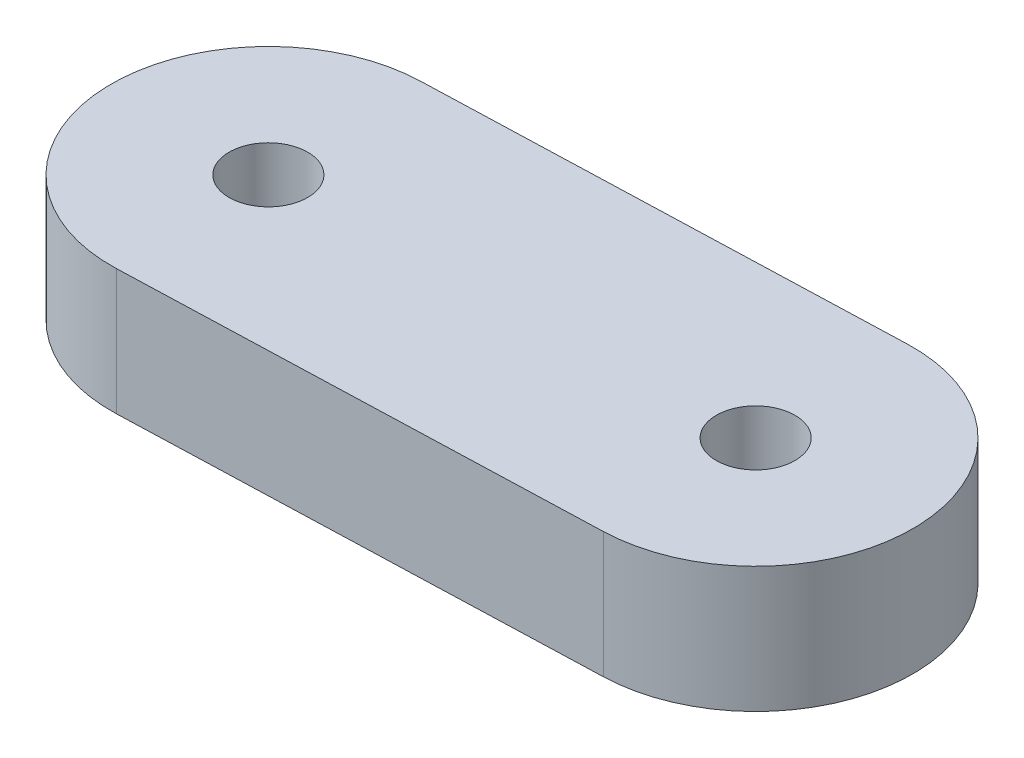
ISO-10303-21;
HEADER;
FILE_DESCRIPTION(('STEP AP214'),'2;1');
FILE_NAME('part.step','',(''),(''),'','','');
FILE_SCHEMA(('AUTOMOTIVE_DESIGN { 1 0 10303 214 1 1 1 1 }'));
ENDSEC;
DATA;
#1=APPLICATION_CONTEXT('core data for automotive mechanical design processes');
#2=APPLICATION_PROTOCOL_DEFINITION('international standard','automotive_design',2000,#1);
#3=PRODUCT_CONTEXT('',#1,'mechanical');
#4=PRODUCT('Part','Part','',(#3));
#5=PRODUCT_RELATED_PRODUCT_CATEGORY('part','',(#4));
#6=PRODUCT_DEFINITION_FORMATION('','',#4);
#7=PRODUCT_DEFINITION_CONTEXT('part definition',#1,'design');
#8=PRODUCT_DEFINITION('design','',#6,#7);
#9=PRODUCT_DEFINITION_SHAPE('','',#8);
#10=(LENGTH_UNIT() NAMED_UNIT(*) SI_UNIT(.MILLI.,.METRE.));
#11=(NAMED_UNIT(*) PLANE_ANGLE_UNIT() SI_UNIT($,.RADIAN.));
#12=(NAMED_UNIT(*) SI_UNIT($,.STERADIAN.) SOLID_ANGLE_UNIT());
#13=UNCERTAINTY_MEASURE_WITH_UNIT(LENGTH_MEASURE(1.E-05),#10,'distance_accuracy_value','');
#14=(GEOMETRIC_REPRESENTATION_CONTEXT(3) GLOBAL_UNCERTAINTY_ASSIGNED_CONTEXT((#13)) GLOBAL_UNIT_ASSIGNED_CONTEXT((#10,
#11,#12)) REPRESENTATION_CONTEXT('',''));
#15=CARTESIAN_POINT('',(0.,0.,0.));
#16=DIRECTION('',(0.,0.,1.));
#17=DIRECTION('',(1.,0.,0.));
#18=AXIS2_PLACEMENT_3D('',#15,#16,#17);
#19=CARTESIAN_POINT('',(0.,80.,0.));
#20=DIRECTION('',(0.,-1.,0.));
#21=DIRECTION('',(0.,0.,-1.));
#22=AXIS2_PLACEMENT_3D('',#19,#20,#21);
#23=CYLINDRICAL_SURFACE('',#22,99.9999999999998);
#24=CARTESIAN_POINT('',(0.,0.,0.));
#25=DIRECTION('',(0.,1.,0.));
#26=DIRECTION('',(0.,0.,1.));
#27=AXIS2_PLACEMENT_3D('',#24,#25,#26);
#28=CIRCLE('',#27,99.9999999999998);
#29=CARTESIAN_POINT('',(3.34615276602981,0.,99.9440006286839));
#30=VERTEX_POINT('',#29);
#31=CARTESIAN_POINT('',(-3.34615276602981,0.,-99.9440006286838));
#32=VERTEX_POINT('',#31);
#33=EDGE_CURVE('E106',#30,#32,#28,.T.);
#34=ORIENTED_EDGE('',*,*,#33,.T.);
#35=DIRECTION('',(0.,-1.,0.));
#36=VECTOR('',#35,1.);
#37=CARTESIAN_POINT('',(-3.34615276602981,80.,-99.9440006286838));
#38=LINE('',#37,#36);
#39=CARTESIAN_POINT('',(-3.34615276602981,80.,-99.9440006286838));
#40=VERTEX_POINT('',#39);
#41=EDGE_CURVE('E11',#40,#32,#38,.T.);
#42=ORIENTED_EDGE('',*,*,#41,.F.);
#43=CARTESIAN_POINT('',(0.,80.,0.));
#44=DIRECTION('',(0.,1.,0.));
#45=DIRECTION('',(0.,0.,1.));
#46=AXIS2_PLACEMENT_3D('',#43,#44,#45);
#47=CIRCLE('',#46,99.9999999999998);
#48=CARTESIAN_POINT('',(3.34615276602981,80.,99.9440006286839));
#49=VERTEX_POINT('',#48);
#50=EDGE_CURVE('E90',#49,#40,#47,.T.);
#51=ORIENTED_EDGE('',*,*,#50,.F.);
#52=DIRECTION('',(0.,-1.,0.));
#53=VECTOR('',#52,1.);
#54=CARTESIAN_POINT('',(3.34615276602981,80.,99.9440006286839));
#55=LINE('',#54,#53);
#56=EDGE_CURVE('E102',#49,#30,#55,.T.);
#57=ORIENTED_EDGE('',*,*,#56,.T.);
#58=EDGE_LOOP('',(#34,#42,#51,#57));
#59=FACE_BOUND('',#58,.T.);
#60=ADVANCED_FACE('F38',(#59),#23,.T.);
#61=CARTESIAN_POINT('',(-3.34615276602981,80.,-99.9440006286838));
#62=DIRECTION('',(0.033461527660298,0.,0.99944000628684));
#63=DIRECTION('',(0.99944000628684,0.,-0.033461527660298));
#64=AXIS2_PLACEMENT_3D('',#61,#62,#63);
#65=PLANE('',#64);
#66=DIRECTION('',(-0.99944000628684,0.,0.033461527660298));
#67=VECTOR('',#66,1.);
#68=CARTESIAN_POINT('',(-3.34615276602981,0.,-99.9440006286838));
#69=LINE('',#68,#67);
#70=CARTESIAN_POINT('',(-303.178154652082,0.,-89.9055423305944));
#71=VERTEX_POINT('',#70);
#72=EDGE_CURVE('E95',#32,#71,#69,.T.);
#73=ORIENTED_EDGE('',*,*,#72,.T.);
#74=DIRECTION('',(0.,-1.,0.));
#75=VECTOR('',#74,1.);
#76=CARTESIAN_POINT('',(-303.178154652082,80.,-89.9055423305944));
#77=LINE('',#76,#75);
#78=CARTESIAN_POINT('',(-303.178154652082,80.,-89.9055423305944));
#79=VERTEX_POINT('',#78);
#80=EDGE_CURVE('E47',#79,#71,#77,.T.);
#81=ORIENTED_EDGE('',*,*,#80,.F.);
#82=DIRECTION('',(-0.99944000628684,0.,0.033461527660298));
#83=VECTOR('',#82,1.);
#84=CARTESIAN_POINT('',(-3.34615276602981,80.,-99.9440006286838));
#85=LINE('',#84,#83);
#86=EDGE_CURVE('E85',#40,#79,#85,.T.);
#87=ORIENTED_EDGE('',*,*,#86,.F.);
#88=ORIENTED_EDGE('',*,*,#41,.T.);
#89=EDGE_LOOP('',(#73,#81,#87,#88));
#90=FACE_BOUND('',#89,.T.);
#91=ADVANCED_FACE('F94',(#90),#65,.F.);
#92=CARTESIAN_POINT('',(-299.832001886052,80.,10.0384582980894));
#93=DIRECTION('',(0.,-1.,0.));
#94=DIRECTION('',(0.,0.,-1.));
#95=AXIS2_PLACEMENT_3D('',#92,#93,#94);
#96=CYLINDRICAL_SURFACE('',#95,99.9999999999999);
#97=CARTESIAN_POINT('',(-299.832001886052,0.,10.0384582980894));
#98=DIRECTION('',(0.,1.,0.));
#99=DIRECTION('',(0.,0.,1.));
#100=AXIS2_PLACEMENT_3D('',#97,#98,#99);
#101=CIRCLE('',#100,99.9999999999999);
#102=CARTESIAN_POINT('',(-296.485849120022,0.,109.982458926773));
#103=VERTEX_POINT('',#102);
#104=EDGE_CURVE('E72',#71,#103,#101,.T.);
#105=ORIENTED_EDGE('',*,*,#104,.T.);
#106=DIRECTION('',(0.,-1.,0.));
#107=VECTOR('',#106,1.);
#108=CARTESIAN_POINT('',(-296.485849120022,80.,109.982458926773));
#109=LINE('',#108,#107);
#110=CARTESIAN_POINT('',(-296.485849120022,80.,109.982458926773));
#111=VERTEX_POINT('',#110);
#112=EDGE_CURVE('E97',#111,#103,#109,.T.);
#113=ORIENTED_EDGE('',*,*,#112,.F.);
#114=CARTESIAN_POINT('',(-299.832001886052,80.,10.0384582980894));
#115=DIRECTION('',(0.,1.,0.));
#116=DIRECTION('',(0.,0.,1.));
#117=AXIS2_PLACEMENT_3D('',#114,#115,#116);
#118=CIRCLE('',#117,99.9999999999999);
#119=EDGE_CURVE('E88',#79,#111,#118,.T.);
#120=ORIENTED_EDGE('',*,*,#119,.F.);
#121=ORIENTED_EDGE('',*,*,#80,.T.);
#122=EDGE_LOOP('',(#105,#113,#120,#121));
#123=FACE_BOUND('',#122,.T.);
#124=ADVANCED_FACE('F98',(#123),#96,.T.);
#125=CARTESIAN_POINT('',(3.34615276602981,80.,99.9440006286839));
#126=DIRECTION('',(-0.0334615276602981,0.,-0.99944000628684));
#127=DIRECTION('',(-0.99944000628684,0.,0.0334615276602981));
#128=AXIS2_PLACEMENT_3D('',#125,#126,#127);
#129=PLANE('',#128);
#130=DIRECTION('',(0.99944000628684,0.,-0.0334615276602981));
#131=VECTOR('',#130,1.);
#132=CARTESIAN_POINT('',(3.34615276602981,0.,99.9440006286839));
#133=LINE('',#132,#131);
#134=EDGE_CURVE('E78',#103,#30,#133,.T.);
#135=ORIENTED_EDGE('',*,*,#134,.T.);
#136=ORIENTED_EDGE('',*,*,#56,.F.);
#137=DIRECTION('',(0.99944000628684,0.,-0.0334615276602981));
#138=VECTOR('',#137,1.);
#139=CARTESIAN_POINT('',(3.34615276602981,80.,99.9440006286839));
#140=LINE('',#139,#138);
#141=EDGE_CURVE('E55',#111,#49,#140,.T.);
#142=ORIENTED_EDGE('',*,*,#141,.F.);
#143=ORIENTED_EDGE('',*,*,#112,.T.);
#144=EDGE_LOOP('',(#135,#136,#142,#143));
#145=FACE_BOUND('',#144,.T.);
#146=ADVANCED_FACE('F120',(#145),#129,.F.);
#147=CARTESIAN_POINT('',(0.,80.,0.));
#148=DIRECTION('',(0.,1.,0.));
#149=DIRECTION('',(0.,0.,1.));
#150=AXIS2_PLACEMENT_3D('',#147,#148,#149);
#151=PLANE('',#150);
#152=CARTESIAN_POINT('',(-299.832001886052,80.,10.0384582980894));
#153=DIRECTION('',(0.,1.,0.));
#154=DIRECTION('',(0.,0.,1.));
#155=AXIS2_PLACEMENT_3D('',#152,#153,#154);
#156=CIRCLE('',#155,25.);
#157=CARTESIAN_POINT('',(-299.832001886052,80.,35.0384582980895));
#158=VERTEX_POINT('',#157);
#159=EDGE_CURVE('E135',#158,#158,#156,.T.);
#160=ORIENTED_EDGE('',*,*,#159,.F.);
#161=EDGE_LOOP('',(#160));
#162=FACE_BOUND('',#161,.T.);
#163=CARTESIAN_POINT('',(0.,80.,0.));
#164=DIRECTION('',(0.,1.,0.));
#165=DIRECTION('',(0.,0.,1.));
#166=AXIS2_PLACEMENT_3D('',#163,#164,#165);
#167=CIRCLE('',#166,25.);
#168=CARTESIAN_POINT('',(0.,80.,25.));
#169=VERTEX_POINT('',#168);
#170=EDGE_CURVE('E127',#169,#169,#167,.T.);
#171=ORIENTED_EDGE('',*,*,#170,.F.);
#172=EDGE_LOOP('',(#171));
#173=FACE_BOUND('',#172,.T.);
#174=ORIENTED_EDGE('',*,*,#50,.T.);
#175=ORIENTED_EDGE('',*,*,#86,.T.);
#176=ORIENTED_EDGE('',*,*,#119,.T.);
#177=ORIENTED_EDGE('',*,*,#141,.T.);
#178=EDGE_LOOP('',(#174,#175,#176,#177));
#179=FACE_BOUND('',#178,.T.);
#180=ADVANCED_FACE('F86',(#162,#173,#179),#151,.T.);
#181=CARTESIAN_POINT('',(0.,0.,0.));
#182=DIRECTION('',(0.,1.,0.));
#183=DIRECTION('',(0.,0.,1.));
#184=AXIS2_PLACEMENT_3D('',#181,#182,#183);
#185=PLANE('',#184);
#186=CARTESIAN_POINT('',(-299.832001886052,0.,10.0384582980894));
#187=DIRECTION('',(0.,1.,0.));
#188=DIRECTION('',(0.,0.,1.));
#189=AXIS2_PLACEMENT_3D('',#186,#187,#188);
#190=CIRCLE('',#189,25.);
#191=CARTESIAN_POINT('',(-299.832001886052,0.,35.0384582980895));
#192=VERTEX_POINT('',#191);
#193=EDGE_CURVE('E131',#192,#192,#190,.T.);
#194=ORIENTED_EDGE('',*,*,#193,.T.);
#195=EDGE_LOOP('',(#194));
#196=FACE_BOUND('',#195,.T.);
#197=ORIENTED_EDGE('',*,*,#33,.F.);
#198=ORIENTED_EDGE('',*,*,#134,.F.);
#199=ORIENTED_EDGE('',*,*,#104,.F.);
#200=ORIENTED_EDGE('',*,*,#72,.F.);
#201=EDGE_LOOP('',(#197,#198,#199,#200));
#202=FACE_BOUND('',#201,.T.);
#203=ADVANCED_FACE('F123',(#196,#202),#185,.F.);
#204=CARTESIAN_POINT('',(0.,30.,0.));
#205=DIRECTION('',(0.,1.,0.));
#206=DIRECTION('',(0.,0.,1.));
#207=AXIS2_PLACEMENT_3D('',#204,#205,#206);
#208=CYLINDRICAL_SURFACE('',#207,25.);
#209=CARTESIAN_POINT('',(0.,30.,0.));
#210=DIRECTION('',(0.,1.,0.));
#211=DIRECTION('',(0.,0.,1.));
#212=AXIS2_PLACEMENT_3D('',#209,#210,#211);
#213=CIRCLE('',#212,25.);
#214=CARTESIAN_POINT('',(0.,30.,25.));
#215=VERTEX_POINT('',#214);
#216=EDGE_CURVE('E110',#215,#215,#213,.T.);
#217=ORIENTED_EDGE('',*,*,#216,.F.);
#218=EDGE_LOOP('',(#217));
#219=FACE_BOUND('',#218,.T.);
#220=ORIENTED_EDGE('',*,*,#170,.T.);
#221=EDGE_LOOP('',(#220));
#222=FACE_BOUND('',#221,.T.);
#223=ADVANCED_FACE('F156',(#219,#222),#208,.F.);
#224=CARTESIAN_POINT('',(0.,30.,0.));
#225=DIRECTION('',(0.,1.,0.));
#226=DIRECTION('',(0.,0.,1.));
#227=AXIS2_PLACEMENT_3D('',#224,#225,#226);
#228=PLANE('',#227);
#229=ORIENTED_EDGE('',*,*,#216,.T.);
#230=EDGE_LOOP('',(#229));
#231=FACE_BOUND('',#230,.T.);
#232=ADVANCED_FACE('F147',(#231),#228,.T.);
#233=CARTESIAN_POINT('',(-299.832001886052,0.,10.0384582980894));
#234=DIRECTION('',(0.,1.,0.));
#235=DIRECTION('',(0.,0.,1.));
#236=AXIS2_PLACEMENT_3D('',#233,#234,#235);
#237=CYLINDRICAL_SURFACE('',#236,25.);
#238=ORIENTED_EDGE('',*,*,#193,.F.);
#239=EDGE_LOOP('',(#238));
#240=FACE_BOUND('',#239,.T.);
#241=ORIENTED_EDGE('',*,*,#159,.T.);
#242=EDGE_LOOP('',(#241));
#243=FACE_BOUND('',#242,.T.);
#244=ADVANCED_FACE('F144',(#240,#243),#237,.F.);
#245=CLOSED_SHELL('',(#60,#91,#124,#146,#180,#203,#223,#232,#244));
#246=MANIFOLD_SOLID_BREP('B2',#245);
#247=ADVANCED_BREP_SHAPE_REPRESENTATION('',(#18,#246),#14);
#248=SHAPE_DEFINITION_REPRESENTATION(#9,#247);
ENDSEC;
END-ISO-10303-21;
